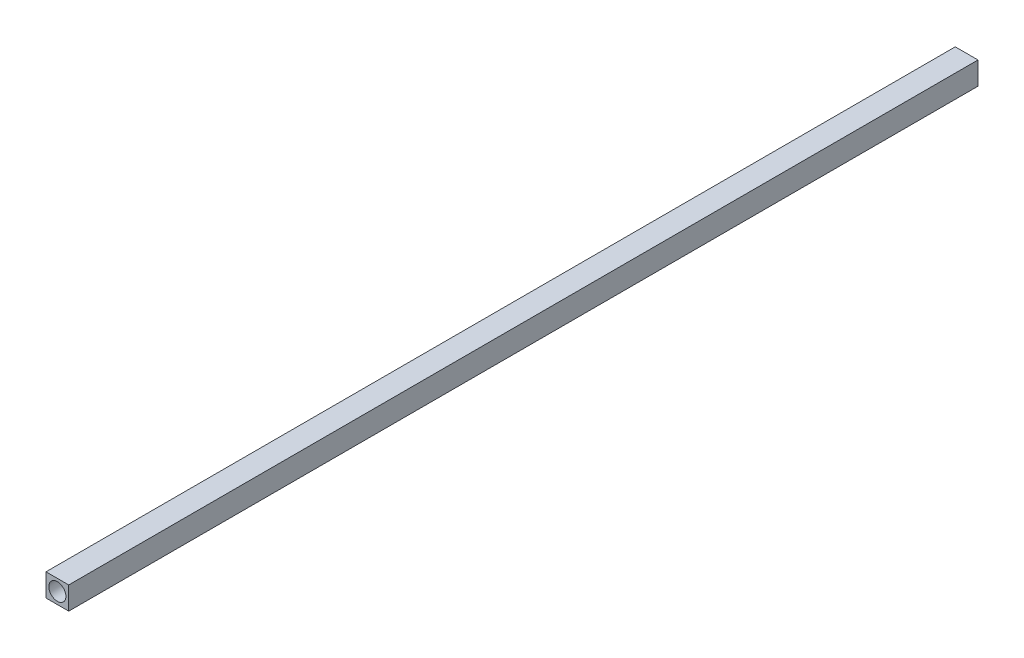
ISO-10303-21;
HEADER;
FILE_DESCRIPTION(('STEP AP214'),'2;1');
FILE_NAME('part.step','',(''),(''),'','','');
FILE_SCHEMA(('AUTOMOTIVE_DESIGN { 1 0 10303 214 1 1 1 1 }'));
ENDSEC;
DATA;
#1=APPLICATION_CONTEXT('core data for automotive mechanical design processes');
#2=APPLICATION_PROTOCOL_DEFINITION('international standard','automotive_design',2000,#1);
#3=PRODUCT_CONTEXT('',#1,'mechanical');
#4=PRODUCT('Part','Part','',(#3));
#5=PRODUCT_RELATED_PRODUCT_CATEGORY('part','',(#4));
#6=PRODUCT_DEFINITION_FORMATION('','',#4);
#7=PRODUCT_DEFINITION_CONTEXT('part definition',#1,'design');
#8=PRODUCT_DEFINITION('design','',#6,#7);
#9=PRODUCT_DEFINITION_SHAPE('','',#8);
#10=(LENGTH_UNIT() NAMED_UNIT(*) SI_UNIT(.MILLI.,.METRE.));
#11=(NAMED_UNIT(*) PLANE_ANGLE_UNIT() SI_UNIT($,.RADIAN.));
#12=(NAMED_UNIT(*) SI_UNIT($,.STERADIAN.) SOLID_ANGLE_UNIT());
#13=UNCERTAINTY_MEASURE_WITH_UNIT(LENGTH_MEASURE(1.E-05),#10,'distance_accuracy_value','');
#14=(GEOMETRIC_REPRESENTATION_CONTEXT(3) GLOBAL_UNCERTAINTY_ASSIGNED_CONTEXT((#13)) GLOBAL_UNIT_ASSIGNED_CONTEXT((#10,
#11,#12)) REPRESENTATION_CONTEXT('',''));
#15=CARTESIAN_POINT('',(0.,0.,0.));
#16=DIRECTION('',(0.,0.,1.));
#17=DIRECTION('',(1.,0.,0.));
#18=AXIS2_PLACEMENT_3D('',#15,#16,#17);
#19=CARTESIAN_POINT('',(0.,0.,160.));
#20=DIRECTION('',(0.,0.,-1.));
#21=DIRECTION('',(-1.,0.,0.));
#22=AXIS2_PLACEMENT_3D('',#19,#20,#21);
#23=PLANE('',#22);
#24=DIRECTION('',(0.,-1.,0.));
#25=VECTOR('',#24,1.);
#26=CARTESIAN_POINT('',(0.,0.,160.));
#27=LINE('',#26,#25);
#28=CARTESIAN_POINT('',(0.,4.,160.));
#29=VERTEX_POINT('',#28);
#30=CARTESIAN_POINT('',(0.,0.,160.));
#31=VERTEX_POINT('',#30);
#32=EDGE_CURVE('E85',#29,#31,#27,.T.);
#33=ORIENTED_EDGE('',*,*,#32,.T.);
#34=DIRECTION('',(1.,0.,0.));
#35=VECTOR('',#34,1.);
#36=CARTESIAN_POINT('',(0.,0.,160.));
#37=LINE('',#36,#35);
#38=CARTESIAN_POINT('',(4.,0.,160.));
#39=VERTEX_POINT('',#38);
#40=EDGE_CURVE('E80',#31,#39,#37,.T.);
#41=ORIENTED_EDGE('',*,*,#40,.T.);
#42=DIRECTION('',(0.,1.,0.));
#43=VECTOR('',#42,1.);
#44=CARTESIAN_POINT('',(4.,0.,160.));
#45=LINE('',#44,#43);
#46=CARTESIAN_POINT('',(4.,4.,160.));
#47=VERTEX_POINT('',#46);
#48=EDGE_CURVE('E83',#39,#47,#45,.T.);
#49=ORIENTED_EDGE('',*,*,#48,.T.);
#50=DIRECTION('',(-1.,0.,0.));
#51=VECTOR('',#50,1.);
#52=CARTESIAN_POINT('',(0.,4.,160.));
#53=LINE('',#52,#51);
#54=EDGE_CURVE('E50',#47,#29,#53,.T.);
#55=ORIENTED_EDGE('',*,*,#54,.T.);
#56=EDGE_LOOP('',(#33,#41,#49,#55));
#57=FACE_BOUND('',#56,.T.);
#58=CARTESIAN_POINT('',(2.,2.,160.));
#59=DIRECTION('',(0.,0.,1.));
#60=DIRECTION('',(1.,0.,0.));
#61=AXIS2_PLACEMENT_3D('',#58,#59,#60);
#62=CIRCLE('',#61,1.5);
#63=CARTESIAN_POINT('',(3.5,2.,160.));
#64=VERTEX_POINT('',#63);
#65=EDGE_CURVE('E100',#64,#64,#62,.T.);
#66=ORIENTED_EDGE('',*,*,#65,.F.);
#67=EDGE_LOOP('',(#66));
#68=FACE_BOUND('',#67,.T.);
#69=ADVANCED_FACE('F33',(#57,#68),#23,.F.);
#70=CARTESIAN_POINT('',(0.,0.,0.));
#71=DIRECTION('',(0.,0.,-1.));
#72=DIRECTION('',(-1.,0.,0.));
#73=AXIS2_PLACEMENT_3D('',#70,#71,#72);
#74=PLANE('',#73);
#75=DIRECTION('',(0.,-1.,0.));
#76=VECTOR('',#75,1.);
#77=CARTESIAN_POINT('',(0.,0.,0.));
#78=LINE('',#77,#76);
#79=CARTESIAN_POINT('',(0.,4.,0.));
#80=VERTEX_POINT('',#79);
#81=CARTESIAN_POINT('',(0.,0.,0.));
#82=VERTEX_POINT('',#81);
#83=EDGE_CURVE('E97',#80,#82,#78,.T.);
#84=ORIENTED_EDGE('',*,*,#83,.F.);
#85=DIRECTION('',(-1.,0.,0.));
#86=VECTOR('',#85,1.);
#87=CARTESIAN_POINT('',(0.,4.,0.));
#88=LINE('',#87,#86);
#89=CARTESIAN_POINT('',(4.,4.,0.));
#90=VERTEX_POINT('',#89);
#91=EDGE_CURVE('E73',#90,#80,#88,.T.);
#92=ORIENTED_EDGE('',*,*,#91,.F.);
#93=DIRECTION('',(0.,1.,0.));
#94=VECTOR('',#93,1.);
#95=CARTESIAN_POINT('',(4.,0.,0.));
#96=LINE('',#95,#94);
#97=CARTESIAN_POINT('',(4.,0.,0.));
#98=VERTEX_POINT('',#97);
#99=EDGE_CURVE('E67',#98,#90,#96,.T.);
#100=ORIENTED_EDGE('',*,*,#99,.F.);
#101=DIRECTION('',(1.,0.,0.));
#102=VECTOR('',#101,1.);
#103=CARTESIAN_POINT('',(0.,0.,0.));
#104=LINE('',#103,#102);
#105=EDGE_CURVE('E89',#82,#98,#104,.T.);
#106=ORIENTED_EDGE('',*,*,#105,.F.);
#107=EDGE_LOOP('',(#84,#92,#100,#106));
#108=FACE_BOUND('',#107,.T.);
#109=CARTESIAN_POINT('',(2.,2.,0.));
#110=DIRECTION('',(0.,0.,1.));
#111=DIRECTION('',(1.,0.,0.));
#112=AXIS2_PLACEMENT_3D('',#109,#110,#111);
#113=CIRCLE('',#112,1.5);
#114=CARTESIAN_POINT('',(3.5,2.,0.));
#115=VERTEX_POINT('',#114);
#116=EDGE_CURVE('E112',#115,#115,#113,.T.);
#117=ORIENTED_EDGE('',*,*,#116,.T.);
#118=EDGE_LOOP('',(#117));
#119=FACE_BOUND('',#118,.T.);
#120=ADVANCED_FACE('F108',(#108,#119),#74,.T.);
#121=CARTESIAN_POINT('',(0.,0.,160.));
#122=DIRECTION('',(1.,0.,0.));
#123=DIRECTION('',(0.,1.,0.));
#124=AXIS2_PLACEMENT_3D('',#121,#122,#123);
#125=PLANE('',#124);
#126=ORIENTED_EDGE('',*,*,#83,.T.);
#127=DIRECTION('',(0.,0.,-1.));
#128=VECTOR('',#127,1.);
#129=CARTESIAN_POINT('',(0.,0.,160.));
#130=LINE('',#129,#128);
#131=EDGE_CURVE('E11',#31,#82,#130,.T.);
#132=ORIENTED_EDGE('',*,*,#131,.F.);
#133=ORIENTED_EDGE('',*,*,#32,.F.);
#134=DIRECTION('',(0.,0.,-1.));
#135=VECTOR('',#134,1.);
#136=CARTESIAN_POINT('',(0.,4.,160.));
#137=LINE('',#136,#135);
#138=EDGE_CURVE('E93',#29,#80,#137,.T.);
#139=ORIENTED_EDGE('',*,*,#138,.T.);
#140=EDGE_LOOP('',(#126,#132,#133,#139));
#141=FACE_BOUND('',#140,.T.);
#142=ADVANCED_FACE('F35',(#141),#125,.F.);
#143=CARTESIAN_POINT('',(0.,0.,160.));
#144=DIRECTION('',(0.,1.,0.));
#145=DIRECTION('',(0.,0.,1.));
#146=AXIS2_PLACEMENT_3D('',#143,#144,#145);
#147=PLANE('',#146);
#148=ORIENTED_EDGE('',*,*,#105,.T.);
#149=DIRECTION('',(0.,0.,-1.));
#150=VECTOR('',#149,1.);
#151=CARTESIAN_POINT('',(4.,0.,160.));
#152=LINE('',#151,#150);
#153=EDGE_CURVE('E42',#39,#98,#152,.T.);
#154=ORIENTED_EDGE('',*,*,#153,.F.);
#155=ORIENTED_EDGE('',*,*,#40,.F.);
#156=ORIENTED_EDGE('',*,*,#131,.T.);
#157=EDGE_LOOP('',(#148,#154,#155,#156));
#158=FACE_BOUND('',#157,.T.);
#159=ADVANCED_FACE('F88',(#158),#147,.F.);
#160=CARTESIAN_POINT('',(4.,0.,160.));
#161=DIRECTION('',(-1.,0.,0.));
#162=DIRECTION('',(0.,-1.,0.));
#163=AXIS2_PLACEMENT_3D('',#160,#161,#162);
#164=PLANE('',#163);
#165=ORIENTED_EDGE('',*,*,#99,.T.);
#166=DIRECTION('',(0.,0.,-1.));
#167=VECTOR('',#166,1.);
#168=CARTESIAN_POINT('',(4.,4.,160.));
#169=LINE('',#168,#167);
#170=EDGE_CURVE('E90',#47,#90,#169,.T.);
#171=ORIENTED_EDGE('',*,*,#170,.F.);
#172=ORIENTED_EDGE('',*,*,#48,.F.);
#173=ORIENTED_EDGE('',*,*,#153,.T.);
#174=EDGE_LOOP('',(#165,#171,#172,#173));
#175=FACE_BOUND('',#174,.T.);
#176=ADVANCED_FACE('F91',(#175),#164,.F.);
#177=CARTESIAN_POINT('',(0.,4.,160.));
#178=DIRECTION('',(0.,-1.,0.));
#179=DIRECTION('',(0.,0.,-1.));
#180=AXIS2_PLACEMENT_3D('',#177,#178,#179);
#181=PLANE('',#180);
#182=ORIENTED_EDGE('',*,*,#91,.T.);
#183=ORIENTED_EDGE('',*,*,#138,.F.);
#184=ORIENTED_EDGE('',*,*,#54,.F.);
#185=ORIENTED_EDGE('',*,*,#170,.T.);
#186=EDGE_LOOP('',(#182,#183,#184,#185));
#187=FACE_BOUND('',#186,.T.);
#188=ADVANCED_FACE('F105',(#187),#181,.F.);
#189=CARTESIAN_POINT('',(2.,2.,160.));
#190=DIRECTION('',(0.,0.,-1.));
#191=DIRECTION('',(-1.,0.,0.));
#192=AXIS2_PLACEMENT_3D('',#189,#190,#191);
#193=CYLINDRICAL_SURFACE('',#192,1.5);
#194=ORIENTED_EDGE('',*,*,#65,.T.);
#195=EDGE_LOOP('',(#194));
#196=FACE_BOUND('',#195,.T.);
#197=ORIENTED_EDGE('',*,*,#116,.F.);
#198=EDGE_LOOP('',(#197));
#199=FACE_BOUND('',#198,.T.);
#200=ADVANCED_FACE('F118',(#196,#199),#193,.F.);
#201=CLOSED_SHELL('',(#69,#120,#142,#159,#176,#188,#200));
#202=MANIFOLD_SOLID_BREP('B2',#201);
#203=ADVANCED_BREP_SHAPE_REPRESENTATION('',(#18,#202),#14);
#204=SHAPE_DEFINITION_REPRESENTATION(#9,#203);
ENDSEC;
END-ISO-10303-21;
